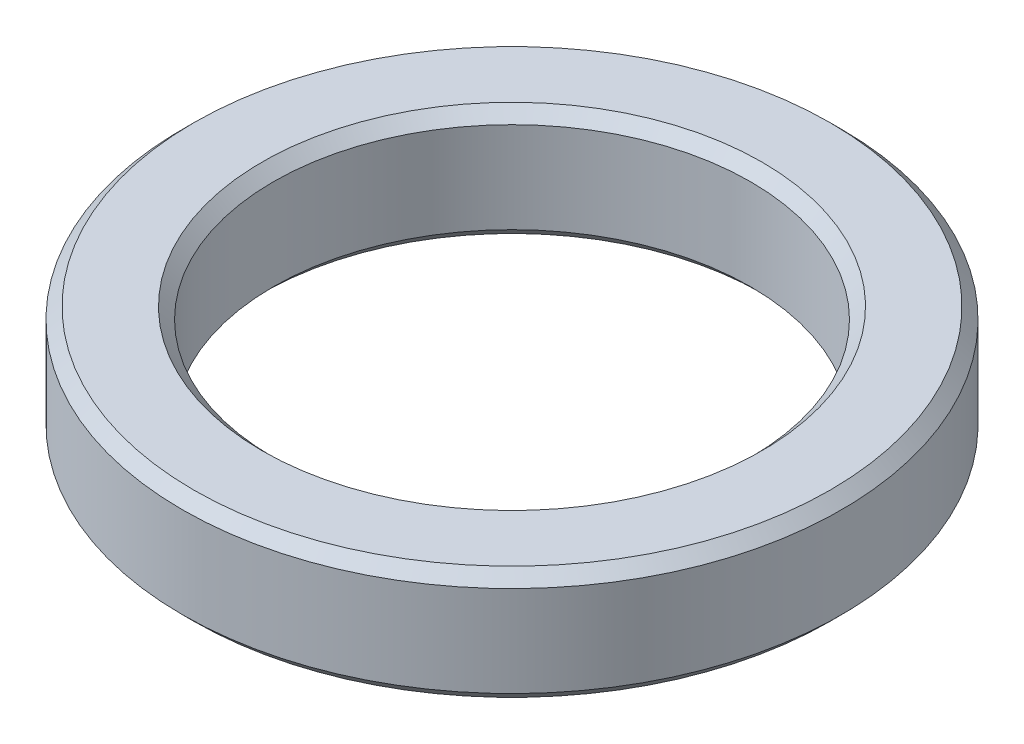
ISO-10303-21;
HEADER;
FILE_DESCRIPTION(('STEP AP214'),'2;1');
FILE_NAME('part.step','',(''),(''),'','','');
FILE_SCHEMA(('AUTOMOTIVE_DESIGN { 1 0 10303 214 1 1 1 1 }'));
ENDSEC;
DATA;
#1=APPLICATION_CONTEXT('core data for automotive mechanical design processes');
#2=APPLICATION_PROTOCOL_DEFINITION('international standard','automotive_design',2000,#1);
#3=PRODUCT_CONTEXT('',#1,'mechanical');
#4=PRODUCT('Part','Part','',(#3));
#5=PRODUCT_RELATED_PRODUCT_CATEGORY('part','',(#4));
#6=PRODUCT_DEFINITION_FORMATION('','',#4);
#7=PRODUCT_DEFINITION_CONTEXT('part definition',#1,'design');
#8=PRODUCT_DEFINITION('design','',#6,#7);
#9=PRODUCT_DEFINITION_SHAPE('','',#8);
#10=(LENGTH_UNIT() NAMED_UNIT(*) SI_UNIT(.MILLI.,.METRE.));
#11=(NAMED_UNIT(*) PLANE_ANGLE_UNIT() SI_UNIT($,.RADIAN.));
#12=(NAMED_UNIT(*) SI_UNIT($,.STERADIAN.) SOLID_ANGLE_UNIT());
#13=UNCERTAINTY_MEASURE_WITH_UNIT(LENGTH_MEASURE(1.E-05),#10,'distance_accuracy_value','');
#14=(GEOMETRIC_REPRESENTATION_CONTEXT(3) GLOBAL_UNCERTAINTY_ASSIGNED_CONTEXT((#13)) GLOBAL_UNIT_ASSIGNED_CONTEXT((#10,
#11,#12)) REPRESENTATION_CONTEXT('',''));
#15=CARTESIAN_POINT('',(0.,0.,0.));
#16=DIRECTION('',(0.,0.,1.));
#17=DIRECTION('',(1.,0.,0.));
#18=AXIS2_PLACEMENT_3D('',#15,#16,#17);
#19=CARTESIAN_POINT('',(0.,5.,0.));
#20=DIRECTION('',(0.,1.,0.));
#21=DIRECTION('',(0.,0.,1.));
#22=AXIS2_PLACEMENT_3D('',#19,#20,#21);
#23=PLANE('',#22);
#24=CARTESIAN_POINT('',(0.,5.,0.));
#25=DIRECTION('',(0.,1.,0.));
#26=DIRECTION('',(0.,0.,1.));
#27=AXIS2_PLACEMENT_3D('',#24,#25,#26);
#28=CIRCLE('',#27,11.);
#29=CARTESIAN_POINT('',(0.,5.,11.));
#30=VERTEX_POINT('',#29);
#31=EDGE_CURVE('E10',#30,#30,#28,.F.);
#32=ORIENTED_EDGE('',*,*,#31,.T.);
#33=EDGE_LOOP('',(#32));
#34=FACE_BOUND('',#33,.T.);
#35=CARTESIAN_POINT('',(0.,5.,0.));
#36=DIRECTION('',(0.,1.,0.));
#37=DIRECTION('',(0.,0.,1.));
#38=AXIS2_PLACEMENT_3D('',#35,#36,#37);
#39=CIRCLE('',#38,14.);
#40=CARTESIAN_POINT('',(0.,5.,14.));
#41=VERTEX_POINT('',#40);
#42=EDGE_CURVE('E39',#41,#41,#39,.T.);
#43=ORIENTED_EDGE('',*,*,#42,.T.);
#44=EDGE_LOOP('',(#43));
#45=FACE_BOUND('',#44,.T.);
#46=ADVANCED_FACE('F32',(#34,#45),#23,.T.);
#47=CARTESIAN_POINT('',(0.,0.,0.));
#48=DIRECTION('',(0.,1.,0.));
#49=DIRECTION('',(0.,0.,1.));
#50=AXIS2_PLACEMENT_3D('',#47,#48,#49);
#51=PLANE('',#50);
#52=CARTESIAN_POINT('',(0.,0.,0.));
#53=DIRECTION('',(0.,1.,0.));
#54=DIRECTION('',(0.,0.,1.));
#55=AXIS2_PLACEMENT_3D('',#52,#53,#54);
#56=CIRCLE('',#55,11.);
#57=CARTESIAN_POINT('',(0.,0.,11.));
#58=VERTEX_POINT('',#57);
#59=EDGE_CURVE('E58',#58,#58,#56,.T.);
#60=ORIENTED_EDGE('',*,*,#59,.T.);
#61=EDGE_LOOP('',(#60));
#62=FACE_BOUND('',#61,.T.);
#63=CARTESIAN_POINT('',(0.,0.,0.));
#64=DIRECTION('',(0.,1.,0.));
#65=DIRECTION('',(0.,0.,1.));
#66=AXIS2_PLACEMENT_3D('',#63,#64,#65);
#67=CIRCLE('',#66,14.);
#68=CARTESIAN_POINT('',(0.,0.,14.));
#69=VERTEX_POINT('',#68);
#70=EDGE_CURVE('E61',#69,#69,#67,.F.);
#71=ORIENTED_EDGE('',*,*,#70,.T.);
#72=EDGE_LOOP('',(#71));
#73=FACE_BOUND('',#72,.T.);
#74=ADVANCED_FACE('F65',(#62,#73),#51,.F.);
#75=CARTESIAN_POINT('',(0.,5.,0.));
#76=DIRECTION('',(0.,-1.,0.));
#77=DIRECTION('',(0.,0.,-1.));
#78=AXIS2_PLACEMENT_3D('',#75,#76,#77);
#79=CYLINDRICAL_SURFACE('',#78,14.5);
#80=CARTESIAN_POINT('',(0.,0.500000000000009,0.));
#81=DIRECTION('',(0.,1.,0.));
#82=DIRECTION('',(0.,0.,1.));
#83=AXIS2_PLACEMENT_3D('',#80,#81,#82);
#84=CIRCLE('',#83,14.5);
#85=CARTESIAN_POINT('',(0.,0.500000000000009,14.5));
#86=VERTEX_POINT('',#85);
#87=EDGE_CURVE('E43',#86,#86,#84,.T.);
#88=ORIENTED_EDGE('',*,*,#87,.T.);
#89=EDGE_LOOP('',(#88));
#90=FACE_BOUND('',#89,.T.);
#91=CARTESIAN_POINT('',(0.,4.49999999999999,0.));
#92=DIRECTION('',(0.,1.,0.));
#93=DIRECTION('',(0.,0.,1.));
#94=AXIS2_PLACEMENT_3D('',#91,#92,#93);
#95=CIRCLE('',#94,14.5);
#96=CARTESIAN_POINT('',(0.,4.49999999999999,14.5));
#97=VERTEX_POINT('',#96);
#98=EDGE_CURVE('E47',#97,#97,#95,.F.);
#99=ORIENTED_EDGE('',*,*,#98,.T.);
#100=EDGE_LOOP('',(#99));
#101=FACE_BOUND('',#100,.T.);
#102=ADVANCED_FACE('F75',(#90,#101),#79,.T.);
#103=CARTESIAN_POINT('',(0.,5.,0.));
#104=DIRECTION('',(0.,-1.,0.));
#105=DIRECTION('',(0.,0.,-1.));
#106=AXIS2_PLACEMENT_3D('',#103,#104,#105);
#107=CYLINDRICAL_SURFACE('',#106,10.5);
#108=CARTESIAN_POINT('',(0.,0.500000000000006,0.));
#109=DIRECTION('',(0.,1.,0.));
#110=DIRECTION('',(0.,0.,1.));
#111=AXIS2_PLACEMENT_3D('',#108,#109,#110);
#112=CIRCLE('',#111,10.5);
#113=CARTESIAN_POINT('',(0.,0.500000000000006,10.5));
#114=VERTEX_POINT('',#113);
#115=EDGE_CURVE('E52',#114,#114,#112,.F.);
#116=ORIENTED_EDGE('',*,*,#115,.T.);
#117=EDGE_LOOP('',(#116));
#118=FACE_BOUND('',#117,.T.);
#119=CARTESIAN_POINT('',(0.,4.5,0.));
#120=DIRECTION('',(0.,1.,0.));
#121=DIRECTION('',(0.,0.,1.));
#122=AXIS2_PLACEMENT_3D('',#119,#120,#121);
#123=CIRCLE('',#122,10.5);
#124=CARTESIAN_POINT('',(0.,4.5,10.5));
#125=VERTEX_POINT('',#124);
#126=EDGE_CURVE('E55',#125,#125,#123,.T.);
#127=ORIENTED_EDGE('',*,*,#126,.T.);
#128=EDGE_LOOP('',(#127));
#129=FACE_BOUND('',#128,.T.);
#130=ADVANCED_FACE('F78',(#118,#129),#107,.F.);
#131=CARTESIAN_POINT('',(0.,0.,0.));
#132=DIRECTION('',(0.,-1.,0.));
#133=DIRECTION('',(0.,0.,-1.));
#134=AXIS2_PLACEMENT_3D('',#131,#132,#133);
#135=CONICAL_SURFACE('',#134,11.,0.785398163397448);
#136=ORIENTED_EDGE('',*,*,#115,.F.);
#137=EDGE_LOOP('',(#136));
#138=FACE_BOUND('',#137,.T.);
#139=ORIENTED_EDGE('',*,*,#59,.F.);
#140=EDGE_LOOP('',(#139));
#141=FACE_BOUND('',#140,.T.);
#142=ADVANCED_FACE('F71',(#138,#141),#135,.F.);
#143=CARTESIAN_POINT('',(0.,0.500000000000009,0.));
#144=DIRECTION('',(0.,1.,0.));
#145=DIRECTION('',(0.,0.,1.));
#146=AXIS2_PLACEMENT_3D('',#143,#144,#145);
#147=CONICAL_SURFACE('',#146,14.5,0.785398163397452);
#148=ORIENTED_EDGE('',*,*,#70,.F.);
#149=EDGE_LOOP('',(#148));
#150=FACE_BOUND('',#149,.T.);
#151=ORIENTED_EDGE('',*,*,#87,.F.);
#152=EDGE_LOOP('',(#151));
#153=FACE_BOUND('',#152,.T.);
#154=ADVANCED_FACE('F67',(#150,#153),#147,.T.);
#155=CARTESIAN_POINT('',(0.,4.5,0.));
#156=DIRECTION('',(0.,1.,0.));
#157=DIRECTION('',(0.,0.,1.));
#158=AXIS2_PLACEMENT_3D('',#155,#156,#157);
#159=CONICAL_SURFACE('',#158,10.5,0.785398163397448);
#160=ORIENTED_EDGE('',*,*,#31,.F.);
#161=EDGE_LOOP('',(#160));
#162=FACE_BOUND('',#161,.T.);
#163=ORIENTED_EDGE('',*,*,#126,.F.);
#164=EDGE_LOOP('',(#163));
#165=FACE_BOUND('',#164,.T.);
#166=ADVANCED_FACE('F70',(#162,#165),#159,.F.);
#167=CARTESIAN_POINT('',(0.,5.,0.));
#168=DIRECTION('',(0.,-1.,0.));
#169=DIRECTION('',(0.,0.,-1.));
#170=AXIS2_PLACEMENT_3D('',#167,#168,#169);
#171=CONICAL_SURFACE('',#170,14.,0.785398163397448);
#172=ORIENTED_EDGE('',*,*,#98,.F.);
#173=EDGE_LOOP('',(#172));
#174=FACE_BOUND('',#173,.T.);
#175=ORIENTED_EDGE('',*,*,#42,.F.);
#176=EDGE_LOOP('',(#175));
#177=FACE_BOUND('',#176,.T.);
#178=ADVANCED_FACE('F34',(#174,#177),#171,.T.);
#179=CLOSED_SHELL('',(#46,#74,#102,#130,#142,#154,#166,#178));
#180=MANIFOLD_SOLID_BREP('B2',#179);
#181=ADVANCED_BREP_SHAPE_REPRESENTATION('',(#18,#180),#14);
#182=SHAPE_DEFINITION_REPRESENTATION(#9,#181);
ENDSEC;
END-ISO-10303-21;
